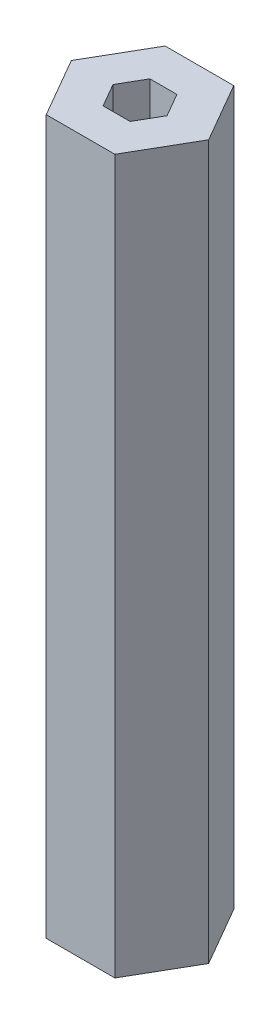
ISO-10303-21;
HEADER;
FILE_DESCRIPTION(('STEP AP214'),'2;1');
FILE_NAME('part.step','',(''),(''),'','','');
FILE_SCHEMA(('AUTOMOTIVE_DESIGN { 1 0 10303 214 1 1 1 1 }'));
ENDSEC;
DATA;
#1=APPLICATION_CONTEXT('core data for automotive mechanical design processes');
#2=APPLICATION_PROTOCOL_DEFINITION('international standard','automotive_design',2000,#1);
#3=PRODUCT_CONTEXT('',#1,'mechanical');
#4=PRODUCT('Part','Part','',(#3));
#5=PRODUCT_RELATED_PRODUCT_CATEGORY('part','',(#4));
#6=PRODUCT_DEFINITION_FORMATION('','',#4);
#7=PRODUCT_DEFINITION_CONTEXT('part definition',#1,'design');
#8=PRODUCT_DEFINITION('design','',#6,#7);
#9=PRODUCT_DEFINITION_SHAPE('','',#8);
#10=(LENGTH_UNIT() NAMED_UNIT(*) SI_UNIT(.MILLI.,.METRE.));
#11=(NAMED_UNIT(*) PLANE_ANGLE_UNIT() SI_UNIT($,.RADIAN.));
#12=(NAMED_UNIT(*) SI_UNIT($,.STERADIAN.) SOLID_ANGLE_UNIT());
#13=UNCERTAINTY_MEASURE_WITH_UNIT(LENGTH_MEASURE(1.E-05),#10,'distance_accuracy_value','');
#14=(GEOMETRIC_REPRESENTATION_CONTEXT(3) GLOBAL_UNCERTAINTY_ASSIGNED_CONTEXT((#13)) GLOBAL_UNIT_ASSIGNED_CONTEXT((#10,
#11,#12)) REPRESENTATION_CONTEXT('',''));
#15=CARTESIAN_POINT('',(0.,0.,0.));
#16=DIRECTION('',(0.,0.,1.));
#17=DIRECTION('',(1.,0.,0.));
#18=AXIS2_PLACEMENT_3D('',#15,#16,#17);
#19=CARTESIAN_POINT('',(0.,76.2,0.));
#20=DIRECTION('',(0.,1.,0.));
#21=DIRECTION('',(0.,0.,1.));
#22=AXIS2_PLACEMENT_3D('',#19,#20,#21);
#23=PLANE('',#22);
#24=DIRECTION('',(0.499999999999995,0.,-0.866025403784441));
#25=VECTOR('',#24,1.);
#26=CARTESIAN_POINT('',(3.6661742093542,76.2,6.34999999999996));
#27=LINE('',#26,#25);
#28=CARTESIAN_POINT('',(3.6661742093542,76.2,6.34999999999996));
#29=VERTEX_POINT('',#28);
#30=CARTESIAN_POINT('',(7.33234841870825,76.2,0.));
#31=VERTEX_POINT('',#30);
#32=EDGE_CURVE('E181',#29,#31,#27,.T.);
#33=ORIENTED_EDGE('',*,*,#32,.T.);
#34=DIRECTION('',(-0.500000000000001,0.,-0.866025403784438));
#35=VECTOR('',#34,1.);
#36=CARTESIAN_POINT('',(7.33234841870825,76.2,0.));
#37=LINE('',#36,#35);
#38=CARTESIAN_POINT('',(3.66617420935411,76.2,-6.35000000000001));
#39=VERTEX_POINT('',#38);
#40=EDGE_CURVE('E184',#31,#39,#37,.T.);
#41=ORIENTED_EDGE('',*,*,#40,.T.);
#42=DIRECTION('',(-1.,0.,0.));
#43=VECTOR('',#42,1.);
#44=CARTESIAN_POINT('',(3.66617420935411,76.2,-6.35000000000001));
#45=LINE('',#44,#43);
#46=CARTESIAN_POINT('',(-3.66617420935415,76.2,-6.34999999999999));
#47=VERTEX_POINT('',#46);
#48=EDGE_CURVE('E187',#39,#47,#45,.T.);
#49=ORIENTED_EDGE('',*,*,#48,.T.);
#50=DIRECTION('',(-0.499999999999995,0.,0.866025403784441));
#51=VECTOR('',#50,1.);
#52=CARTESIAN_POINT('',(-3.66617420935415,76.2,-6.34999999999999));
#53=LINE('',#52,#51);
#54=CARTESIAN_POINT('',(-7.33234841870825,76.2,0.));
#55=VERTEX_POINT('',#54);
#56=EDGE_CURVE('E189',#47,#55,#53,.T.);
#57=ORIENTED_EDGE('',*,*,#56,.T.);
#58=DIRECTION('',(0.500000000000007,0.,0.866025403784434));
#59=VECTOR('',#58,1.);
#60=CARTESIAN_POINT('',(-7.33234841870825,76.2,0.));
#61=LINE('',#60,#59);
#62=CARTESIAN_POINT('',(-3.66617420935407,76.2,6.35000000000004));
#63=VERTEX_POINT('',#62);
#64=EDGE_CURVE('E191',#55,#63,#61,.T.);
#65=ORIENTED_EDGE('',*,*,#64,.T.);
#66=DIRECTION('',(1.,0.,0.));
#67=VECTOR('',#66,1.);
#68=CARTESIAN_POINT('',(-3.66617420935407,76.2,6.35000000000004));
#69=LINE('',#68,#67);
#70=EDGE_CURVE('E193',#63,#29,#69,.T.);
#71=ORIENTED_EDGE('',*,*,#70,.T.);
#72=EDGE_LOOP('',(#33,#41,#49,#57,#65,#71));
#73=FACE_BOUND('',#72,.T.);
#74=DIRECTION('',(-0.5,0.,-0.866025403784439));
#75=VECTOR('',#74,1.);
#76=CARTESIAN_POINT('',(2.88675134594813,76.2,0.));
#77=LINE('',#76,#75);
#78=CARTESIAN_POINT('',(2.88675134594813,76.2,0.));
#79=VERTEX_POINT('',#78);
#80=CARTESIAN_POINT('',(1.44337567297406,76.2,-2.5));
#81=VERTEX_POINT('',#80);
#82=EDGE_CURVE('E138',#79,#81,#77,.T.);
#83=ORIENTED_EDGE('',*,*,#82,.F.);
#84=DIRECTION('',(0.5,0.,-0.866025403784439));
#85=VECTOR('',#84,1.);
#86=CARTESIAN_POINT('',(1.44337567297407,76.2,2.5));
#87=LINE('',#86,#85);
#88=CARTESIAN_POINT('',(1.44337567297407,76.2,2.5));
#89=VERTEX_POINT('',#88);
#90=EDGE_CURVE('E130',#89,#79,#87,.T.);
#91=ORIENTED_EDGE('',*,*,#90,.F.);
#92=DIRECTION('',(1.,0.,0.));
#93=VECTOR('',#92,1.);
#94=CARTESIAN_POINT('',(-1.44337567297406,76.2,2.5));
#95=LINE('',#94,#93);
#96=CARTESIAN_POINT('',(-1.44337567297406,76.2,2.5));
#97=VERTEX_POINT('',#96);
#98=EDGE_CURVE('E159',#97,#89,#95,.T.);
#99=ORIENTED_EDGE('',*,*,#98,.F.);
#100=DIRECTION('',(0.5,0.,0.866025403784439));
#101=VECTOR('',#100,1.);
#102=CARTESIAN_POINT('',(-2.88675134594813,76.2,0.));
#103=LINE('',#102,#101);
#104=CARTESIAN_POINT('',(-2.88675134594813,76.2,0.));
#105=VERTEX_POINT('',#104);
#106=EDGE_CURVE('E157',#105,#97,#103,.T.);
#107=ORIENTED_EDGE('',*,*,#106,.F.);
#108=DIRECTION('',(-0.5,0.,0.866025403784439));
#109=VECTOR('',#108,1.);
#110=CARTESIAN_POINT('',(-1.44337567297406,76.2,-2.5));
#111=LINE('',#110,#109);
#112=CARTESIAN_POINT('',(-1.44337567297406,76.2,-2.5));
#113=VERTEX_POINT('',#112);
#114=EDGE_CURVE('E153',#113,#105,#111,.T.);
#115=ORIENTED_EDGE('',*,*,#114,.F.);
#116=DIRECTION('',(-1.,0.,0.));
#117=VECTOR('',#116,1.);
#118=CARTESIAN_POINT('',(1.44337567297406,76.2,-2.5));
#119=LINE('',#118,#117);
#120=EDGE_CURVE('E151',#81,#113,#119,.T.);
#121=ORIENTED_EDGE('',*,*,#120,.F.);
#122=EDGE_LOOP('',(#83,#91,#99,#107,#115,#121));
#123=FACE_BOUND('',#122,.T.);
#124=ADVANCED_FACE('F41',(#73,#123),#23,.T.);
#125=CARTESIAN_POINT('',(0.,0.,0.));
#126=DIRECTION('',(0.,1.,0.));
#127=DIRECTION('',(0.,0.,1.));
#128=AXIS2_PLACEMENT_3D('',#125,#126,#127);
#129=PLANE('',#128);
#130=DIRECTION('',(0.499999999999995,0.,-0.866025403784441));
#131=VECTOR('',#130,1.);
#132=CARTESIAN_POINT('',(3.6661742093542,0.,6.34999999999996));
#133=LINE('',#132,#131);
#134=CARTESIAN_POINT('',(3.6661742093542,0.,6.34999999999996));
#135=VERTEX_POINT('',#134);
#136=CARTESIAN_POINT('',(7.33234841870825,0.,0.));
#137=VERTEX_POINT('',#136);
#138=EDGE_CURVE('E146',#135,#137,#133,.T.);
#139=ORIENTED_EDGE('',*,*,#138,.F.);
#140=DIRECTION('',(1.,0.,0.));
#141=VECTOR('',#140,1.);
#142=CARTESIAN_POINT('',(-3.66617420935407,0.,6.35000000000004));
#143=LINE('',#142,#141);
#144=CARTESIAN_POINT('',(-3.66617420935407,0.,6.35000000000004));
#145=VERTEX_POINT('',#144);
#146=EDGE_CURVE('E185',#145,#135,#143,.T.);
#147=ORIENTED_EDGE('',*,*,#146,.F.);
#148=DIRECTION('',(0.500000000000007,0.,0.866025403784434));
#149=VECTOR('',#148,1.);
#150=CARTESIAN_POINT('',(-7.33234841870825,0.,0.));
#151=LINE('',#150,#149);
#152=CARTESIAN_POINT('',(-7.33234841870825,0.,0.));
#153=VERTEX_POINT('',#152);
#154=EDGE_CURVE('E204',#153,#145,#151,.T.);
#155=ORIENTED_EDGE('',*,*,#154,.F.);
#156=DIRECTION('',(-0.499999999999995,0.,0.866025403784441));
#157=VECTOR('',#156,1.);
#158=CARTESIAN_POINT('',(-3.66617420935415,0.,-6.34999999999999));
#159=LINE('',#158,#157);
#160=CARTESIAN_POINT('',(-3.66617420935415,0.,-6.34999999999999));
#161=VERTEX_POINT('',#160);
#162=EDGE_CURVE('E202',#161,#153,#159,.T.);
#163=ORIENTED_EDGE('',*,*,#162,.F.);
#164=DIRECTION('',(-1.,0.,0.));
#165=VECTOR('',#164,1.);
#166=CARTESIAN_POINT('',(3.66617420935411,0.,-6.35000000000001));
#167=LINE('',#166,#165);
#168=CARTESIAN_POINT('',(3.66617420935411,0.,-6.35000000000001));
#169=VERTEX_POINT('',#168);
#170=EDGE_CURVE('E200',#169,#161,#167,.T.);
#171=ORIENTED_EDGE('',*,*,#170,.F.);
#172=DIRECTION('',(-0.500000000000001,0.,-0.866025403784438));
#173=VECTOR('',#172,1.);
#174=CARTESIAN_POINT('',(7.33234841870825,0.,0.));
#175=LINE('',#174,#173);
#176=EDGE_CURVE('E198',#137,#169,#175,.T.);
#177=ORIENTED_EDGE('',*,*,#176,.F.);
#178=EDGE_LOOP('',(#139,#147,#155,#163,#171,#177));
#179=FACE_BOUND('',#178,.T.);
#180=DIRECTION('',(0.5,0.,-0.866025403784439));
#181=VECTOR('',#180,1.);
#182=CARTESIAN_POINT('',(1.44337567297407,0.,2.5));
#183=LINE('',#182,#181);
#184=CARTESIAN_POINT('',(1.44337567297407,0.,2.5));
#185=VERTEX_POINT('',#184);
#186=CARTESIAN_POINT('',(2.88675134594813,0.,0.));
#187=VERTEX_POINT('',#186);
#188=EDGE_CURVE('E64',#185,#187,#183,.T.);
#189=ORIENTED_EDGE('',*,*,#188,.T.);
#190=DIRECTION('',(-0.5,0.,-0.866025403784439));
#191=VECTOR('',#190,1.);
#192=CARTESIAN_POINT('',(2.88675134594813,0.,0.));
#193=LINE('',#192,#191);
#194=CARTESIAN_POINT('',(1.44337567297406,0.,-2.5));
#195=VERTEX_POINT('',#194);
#196=EDGE_CURVE('E145',#187,#195,#193,.T.);
#197=ORIENTED_EDGE('',*,*,#196,.T.);
#198=DIRECTION('',(-1.,0.,0.));
#199=VECTOR('',#198,1.);
#200=CARTESIAN_POINT('',(1.44337567297406,0.,-2.5));
#201=LINE('',#200,#199);
#202=CARTESIAN_POINT('',(-1.44337567297406,0.,-2.5));
#203=VERTEX_POINT('',#202);
#204=EDGE_CURVE('E163',#195,#203,#201,.T.);
#205=ORIENTED_EDGE('',*,*,#204,.T.);
#206=DIRECTION('',(-0.5,0.,0.866025403784439));
#207=VECTOR('',#206,1.);
#208=CARTESIAN_POINT('',(-1.44337567297406,0.,-2.5));
#209=LINE('',#208,#207);
#210=CARTESIAN_POINT('',(-2.88675134594813,0.,0.));
#211=VERTEX_POINT('',#210);
#212=EDGE_CURVE('E166',#203,#211,#209,.T.);
#213=ORIENTED_EDGE('',*,*,#212,.T.);
#214=DIRECTION('',(0.5,0.,0.866025403784439));
#215=VECTOR('',#214,1.);
#216=CARTESIAN_POINT('',(-2.88675134594813,0.,0.));
#217=LINE('',#216,#215);
#218=CARTESIAN_POINT('',(-1.44337567297406,0.,2.5));
#219=VERTEX_POINT('',#218);
#220=EDGE_CURVE('E169',#211,#219,#217,.T.);
#221=ORIENTED_EDGE('',*,*,#220,.T.);
#222=DIRECTION('',(1.,0.,0.));
#223=VECTOR('',#222,1.);
#224=CARTESIAN_POINT('',(-1.44337567297406,0.,2.5));
#225=LINE('',#224,#223);
#226=EDGE_CURVE('E139',#219,#185,#225,.T.);
#227=ORIENTED_EDGE('',*,*,#226,.T.);
#228=EDGE_LOOP('',(#189,#197,#205,#213,#221,#227));
#229=FACE_BOUND('',#228,.T.);
#230=ADVANCED_FACE('F228',(#179,#229),#129,.F.);
#231=CARTESIAN_POINT('',(3.6661742093542,76.2,6.34999999999996));
#232=DIRECTION('',(-0.866025403784441,0.,-0.499999999999995));
#233=DIRECTION('',(-0.499999999999995,0.,0.866025403784441));
#234=AXIS2_PLACEMENT_3D('',#231,#232,#233);
#235=PLANE('',#234);
#236=ORIENTED_EDGE('',*,*,#138,.T.);
#237=DIRECTION('',(0.,-1.,0.));
#238=VECTOR('',#237,1.);
#239=CARTESIAN_POINT('',(7.33234841870825,76.2,0.));
#240=LINE('',#239,#238);
#241=EDGE_CURVE('E11',#31,#137,#240,.T.);
#242=ORIENTED_EDGE('',*,*,#241,.F.);
#243=ORIENTED_EDGE('',*,*,#32,.F.);
#244=DIRECTION('',(0.,-1.,0.));
#245=VECTOR('',#244,1.);
#246=CARTESIAN_POINT('',(3.6661742093542,76.2,6.34999999999996));
#247=LINE('',#246,#245);
#248=EDGE_CURVE('E195',#29,#135,#247,.T.);
#249=ORIENTED_EDGE('',*,*,#248,.T.);
#250=EDGE_LOOP('',(#236,#242,#243,#249));
#251=FACE_BOUND('',#250,.T.);
#252=ADVANCED_FACE('F43',(#251),#235,.F.);
#253=CARTESIAN_POINT('',(7.33234841870825,76.2,0.));
#254=DIRECTION('',(-0.866025403784438,0.,0.500000000000001));
#255=DIRECTION('',(0.500000000000001,0.,0.866025403784438));
#256=AXIS2_PLACEMENT_3D('',#253,#254,#255);
#257=PLANE('',#256);
#258=ORIENTED_EDGE('',*,*,#176,.T.);
#259=DIRECTION('',(0.,-1.,0.));
#260=VECTOR('',#259,1.);
#261=CARTESIAN_POINT('',(3.66617420935411,76.2,-6.35000000000001));
#262=LINE('',#261,#260);
#263=EDGE_CURVE('E49',#39,#169,#262,.T.);
#264=ORIENTED_EDGE('',*,*,#263,.F.);
#265=ORIENTED_EDGE('',*,*,#40,.F.);
#266=ORIENTED_EDGE('',*,*,#241,.T.);
#267=EDGE_LOOP('',(#258,#264,#265,#266));
#268=FACE_BOUND('',#267,.T.);
#269=ADVANCED_FACE('F245',(#268),#257,.F.);
#270=CARTESIAN_POINT('',(3.66617420935411,76.2,-6.35000000000001));
#271=DIRECTION('',(0.,0.,1.));
#272=DIRECTION('',(1.,0.,0.));
#273=AXIS2_PLACEMENT_3D('',#270,#271,#272);
#274=PLANE('',#273);
#275=ORIENTED_EDGE('',*,*,#170,.T.);
#276=DIRECTION('',(0.,-1.,0.));
#277=VECTOR('',#276,1.);
#278=CARTESIAN_POINT('',(-3.66617420935415,76.2,-6.34999999999999));
#279=LINE('',#278,#277);
#280=EDGE_CURVE('E215',#47,#161,#279,.T.);
#281=ORIENTED_EDGE('',*,*,#280,.F.);
#282=ORIENTED_EDGE('',*,*,#48,.F.);
#283=ORIENTED_EDGE('',*,*,#263,.T.);
#284=EDGE_LOOP('',(#275,#281,#282,#283));
#285=FACE_BOUND('',#284,.T.);
#286=ADVANCED_FACE('F222',(#285),#274,.F.);
#287=CARTESIAN_POINT('',(-3.66617420935415,76.2,-6.34999999999999));
#288=DIRECTION('',(0.866025403784442,0.,0.499999999999995));
#289=DIRECTION('',(0.499999999999995,0.,-0.866025403784442));
#290=AXIS2_PLACEMENT_3D('',#287,#288,#289);
#291=PLANE('',#290);
#292=ORIENTED_EDGE('',*,*,#162,.T.);
#293=DIRECTION('',(0.,-1.,0.));
#294=VECTOR('',#293,1.);
#295=CARTESIAN_POINT('',(-7.33234841870825,76.2,0.));
#296=LINE('',#295,#294);
#297=EDGE_CURVE('E212',#55,#153,#296,.T.);
#298=ORIENTED_EDGE('',*,*,#297,.F.);
#299=ORIENTED_EDGE('',*,*,#56,.F.);
#300=ORIENTED_EDGE('',*,*,#280,.T.);
#301=EDGE_LOOP('',(#292,#298,#299,#300));
#302=FACE_BOUND('',#301,.T.);
#303=ADVANCED_FACE('F234',(#302),#291,.F.);
#304=CARTESIAN_POINT('',(-7.33234841870825,76.2,0.));
#305=DIRECTION('',(0.866025403784434,0.,-0.500000000000007));
#306=DIRECTION('',(-0.500000000000007,0.,-0.866025403784435));
#307=AXIS2_PLACEMENT_3D('',#304,#305,#306);
#308=PLANE('',#307);
#309=ORIENTED_EDGE('',*,*,#154,.T.);
#310=DIRECTION('',(0.,-1.,0.));
#311=VECTOR('',#310,1.);
#312=CARTESIAN_POINT('',(-3.66617420935407,76.2,6.35000000000004));
#313=LINE('',#312,#311);
#314=EDGE_CURVE('E209',#63,#145,#313,.T.);
#315=ORIENTED_EDGE('',*,*,#314,.F.);
#316=ORIENTED_EDGE('',*,*,#64,.F.);
#317=ORIENTED_EDGE('',*,*,#297,.T.);
#318=EDGE_LOOP('',(#309,#315,#316,#317));
#319=FACE_BOUND('',#318,.T.);
#320=ADVANCED_FACE('F238',(#319),#308,.F.);
#321=CARTESIAN_POINT('',(-3.66617420935407,76.2,6.35000000000004));
#322=DIRECTION('',(0.,0.,-1.));
#323=DIRECTION('',(-1.,0.,0.));
#324=AXIS2_PLACEMENT_3D('',#321,#322,#323);
#325=PLANE('',#324);
#326=ORIENTED_EDGE('',*,*,#146,.T.);
#327=ORIENTED_EDGE('',*,*,#248,.F.);
#328=ORIENTED_EDGE('',*,*,#70,.F.);
#329=ORIENTED_EDGE('',*,*,#314,.T.);
#330=EDGE_LOOP('',(#326,#327,#328,#329));
#331=FACE_BOUND('',#330,.T.);
#332=ADVANCED_FACE('F248',(#331),#325,.F.);
#333=CARTESIAN_POINT('',(1.44337567297407,76.2,2.5));
#334=DIRECTION('',(-0.866025403784439,0.,-0.5));
#335=DIRECTION('',(-0.5,0.,0.866025403784438));
#336=AXIS2_PLACEMENT_3D('',#333,#334,#335);
#337=PLANE('',#336);
#338=ORIENTED_EDGE('',*,*,#188,.F.);
#339=DIRECTION('',(0.,-1.,0.));
#340=VECTOR('',#339,1.);
#341=CARTESIAN_POINT('',(1.44337567297407,76.2,2.5));
#342=LINE('',#341,#340);
#343=EDGE_CURVE('E134',#89,#185,#342,.T.);
#344=ORIENTED_EDGE('',*,*,#343,.F.);
#345=ORIENTED_EDGE('',*,*,#90,.T.);
#346=DIRECTION('',(0.,-1.,0.));
#347=VECTOR('',#346,1.);
#348=CARTESIAN_POINT('',(2.88675134594813,76.2,0.));
#349=LINE('',#348,#347);
#350=EDGE_CURVE('E133',#79,#187,#349,.T.);
#351=ORIENTED_EDGE('',*,*,#350,.T.);
#352=EDGE_LOOP('',(#338,#344,#345,#351));
#353=FACE_BOUND('',#352,.T.);
#354=ADVANCED_FACE('F132',(#353),#337,.T.);
#355=CARTESIAN_POINT('',(2.88675134594813,76.2,0.));
#356=DIRECTION('',(-0.866025403784439,0.,0.5));
#357=DIRECTION('',(0.5,0.,0.866025403784438));
#358=AXIS2_PLACEMENT_3D('',#355,#356,#357);
#359=PLANE('',#358);
#360=ORIENTED_EDGE('',*,*,#196,.F.);
#361=ORIENTED_EDGE('',*,*,#350,.F.);
#362=ORIENTED_EDGE('',*,*,#82,.T.);
#363=DIRECTION('',(0.,-1.,0.));
#364=VECTOR('',#363,1.);
#365=CARTESIAN_POINT('',(1.44337567297406,76.2,-2.5));
#366=LINE('',#365,#364);
#367=EDGE_CURVE('E147',#81,#195,#366,.T.);
#368=ORIENTED_EDGE('',*,*,#367,.T.);
#369=EDGE_LOOP('',(#360,#361,#362,#368));
#370=FACE_BOUND('',#369,.T.);
#371=ADVANCED_FACE('F142',(#370),#359,.T.);
#372=CARTESIAN_POINT('',(1.44337567297406,76.2,-2.5));
#373=DIRECTION('',(0.,0.,1.));
#374=DIRECTION('',(1.,0.,0.));
#375=AXIS2_PLACEMENT_3D('',#372,#373,#374);
#376=PLANE('',#375);
#377=ORIENTED_EDGE('',*,*,#204,.F.);
#378=ORIENTED_EDGE('',*,*,#367,.F.);
#379=ORIENTED_EDGE('',*,*,#120,.T.);
#380=DIRECTION('',(0.,-1.,0.));
#381=VECTOR('',#380,1.);
#382=CARTESIAN_POINT('',(-1.44337567297406,76.2,-2.5));
#383=LINE('',#382,#381);
#384=EDGE_CURVE('E178',#113,#203,#383,.T.);
#385=ORIENTED_EDGE('',*,*,#384,.T.);
#386=EDGE_LOOP('',(#377,#378,#379,#385));
#387=FACE_BOUND('',#386,.T.);
#388=ADVANCED_FACE('F266',(#387),#376,.T.);
#389=CARTESIAN_POINT('',(-1.44337567297406,76.2,-2.5));
#390=DIRECTION('',(0.866025403784439,0.,0.5));
#391=DIRECTION('',(0.5,0.,-0.866025403784439));
#392=AXIS2_PLACEMENT_3D('',#389,#390,#391);
#393=PLANE('',#392);
#394=ORIENTED_EDGE('',*,*,#212,.F.);
#395=ORIENTED_EDGE('',*,*,#384,.F.);
#396=ORIENTED_EDGE('',*,*,#114,.T.);
#397=DIRECTION('',(0.,-1.,0.));
#398=VECTOR('',#397,1.);
#399=CARTESIAN_POINT('',(-2.88675134594813,76.2,0.));
#400=LINE('',#399,#398);
#401=EDGE_CURVE('E176',#105,#211,#400,.T.);
#402=ORIENTED_EDGE('',*,*,#401,.T.);
#403=EDGE_LOOP('',(#394,#395,#396,#402));
#404=FACE_BOUND('',#403,.T.);
#405=ADVANCED_FACE('F269',(#404),#393,.T.);
#406=CARTESIAN_POINT('',(-2.88675134594813,76.2,0.));
#407=DIRECTION('',(0.866025403784439,0.,-0.5));
#408=DIRECTION('',(-0.5,0.,-0.866025403784438));
#409=AXIS2_PLACEMENT_3D('',#406,#407,#408);
#410=PLANE('',#409);
#411=ORIENTED_EDGE('',*,*,#220,.F.);
#412=ORIENTED_EDGE('',*,*,#401,.F.);
#413=ORIENTED_EDGE('',*,*,#106,.T.);
#414=DIRECTION('',(0.,-1.,0.));
#415=VECTOR('',#414,1.);
#416=CARTESIAN_POINT('',(-1.44337567297406,76.2,2.5));
#417=LINE('',#416,#415);
#418=EDGE_CURVE('E56',#97,#219,#417,.T.);
#419=ORIENTED_EDGE('',*,*,#418,.T.);
#420=EDGE_LOOP('',(#411,#412,#413,#419));
#421=FACE_BOUND('',#420,.T.);
#422=ADVANCED_FACE('F273',(#421),#410,.T.);
#423=CARTESIAN_POINT('',(-1.44337567297406,76.2,2.5));
#424=DIRECTION('',(0.,0.,-1.));
#425=DIRECTION('',(-1.,0.,0.));
#426=AXIS2_PLACEMENT_3D('',#423,#424,#425);
#427=PLANE('',#426);
#428=ORIENTED_EDGE('',*,*,#226,.F.);
#429=ORIENTED_EDGE('',*,*,#418,.F.);
#430=ORIENTED_EDGE('',*,*,#98,.T.);
#431=ORIENTED_EDGE('',*,*,#343,.T.);
#432=EDGE_LOOP('',(#428,#429,#430,#431));
#433=FACE_BOUND('',#432,.T.);
#434=ADVANCED_FACE('F277',(#433),#427,.T.);
#435=CLOSED_SHELL('',(#124,#230,#252,#269,#286,#303,#320,#332,#354,#371,#388,#405,#422,#434));
#436=MANIFOLD_SOLID_BREP('B2',#435);
#437=ADVANCED_BREP_SHAPE_REPRESENTATION('',(#18,#436),#14);
#438=SHAPE_DEFINITION_REPRESENTATION(#9,#437);
ENDSEC;
END-ISO-10303-21;
